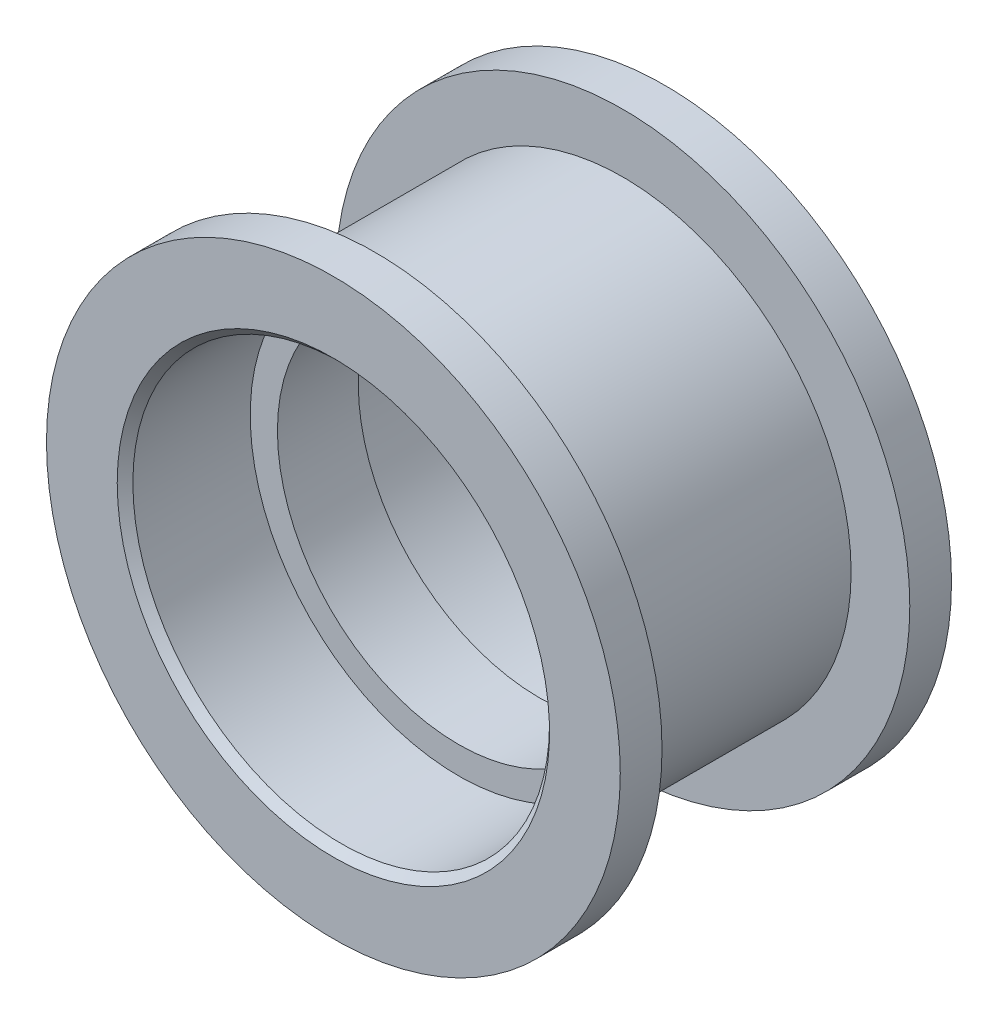
ISO-10303-21;
HEADER;
FILE_DESCRIPTION(('STEP AP214'),'2;1');
FILE_NAME('part.step','',(''),(''),'','','');
FILE_SCHEMA(('AUTOMOTIVE_DESIGN { 1 0 10303 214 1 1 1 1 }'));
ENDSEC;
DATA;
#1=APPLICATION_CONTEXT('core data for automotive mechanical design processes');
#2=APPLICATION_PROTOCOL_DEFINITION('international standard','automotive_design',2000,#1);
#3=PRODUCT_CONTEXT('',#1,'mechanical');
#4=PRODUCT('Part','Part','',(#3));
#5=PRODUCT_RELATED_PRODUCT_CATEGORY('part','',(#4));
#6=PRODUCT_DEFINITION_FORMATION('','',#4);
#7=PRODUCT_DEFINITION_CONTEXT('part definition',#1,'design');
#8=PRODUCT_DEFINITION('design','',#6,#7);
#9=PRODUCT_DEFINITION_SHAPE('','',#8);
#10=(LENGTH_UNIT() NAMED_UNIT(*) SI_UNIT(.MILLI.,.METRE.));
#11=(NAMED_UNIT(*) PLANE_ANGLE_UNIT() SI_UNIT($,.RADIAN.));
#12=(NAMED_UNIT(*) SI_UNIT($,.STERADIAN.) SOLID_ANGLE_UNIT());
#13=UNCERTAINTY_MEASURE_WITH_UNIT(LENGTH_MEASURE(1.E-05),#10,'distance_accuracy_value','');
#14=(GEOMETRIC_REPRESENTATION_CONTEXT(3) GLOBAL_UNCERTAINTY_ASSIGNED_CONTEXT((#13)) GLOBAL_UNIT_ASSIGNED_CONTEXT((#10,
#11,#12)) REPRESENTATION_CONTEXT('',''));
#15=CARTESIAN_POINT('',(0.,0.,0.));
#16=DIRECTION('',(0.,0.,1.));
#17=DIRECTION('',(1.,0.,0.));
#18=AXIS2_PLACEMENT_3D('',#15,#16,#17);
#19=CARTESIAN_POINT('',(0.,0.,0.));
#20=DIRECTION('',(0.,0.,1.));
#21=DIRECTION('',(1.,0.,0.));
#22=AXIS2_PLACEMENT_3D('',#19,#20,#21);
#23=CYLINDRICAL_SURFACE('',#22,6.945);
#24=CARTESIAN_POINT('',(0.,0.,-1.55));
#25=DIRECTION('',(0.,0.,1.));
#26=DIRECTION('',(1.,0.,0.));
#27=AXIS2_PLACEMENT_3D('',#24,#25,#26);
#28=CIRCLE('',#27,6.945);
#29=CARTESIAN_POINT('',(6.945,0.,-1.55));
#30=VERTEX_POINT('',#29);
#31=EDGE_CURVE('E77',#30,#30,#28,.T.);
#32=ORIENTED_EDGE('',*,*,#31,.F.);
#33=EDGE_LOOP('',(#32));
#34=FACE_BOUND('',#33,.T.);
#35=CARTESIAN_POINT('',(0.,0.,1.55));
#36=DIRECTION('',(0.,0.,1.));
#37=DIRECTION('',(1.,0.,0.));
#38=AXIS2_PLACEMENT_3D('',#35,#36,#37);
#39=CIRCLE('',#38,6.945);
#40=CARTESIAN_POINT('',(6.945,0.,1.55));
#41=VERTEX_POINT('',#40);
#42=EDGE_CURVE('E50',#41,#41,#39,.T.);
#43=ORIENTED_EDGE('',*,*,#42,.T.);
#44=EDGE_LOOP('',(#43));
#45=FACE_BOUND('',#44,.T.);
#46=ADVANCED_FACE('F30',(#34,#45),#23,.F.);
#47=CARTESIAN_POINT('',(0.,7.9875,1.55));
#48=DIRECTION('',(0.,0.,-1.));
#49=DIRECTION('',(-1.,0.,0.));
#50=AXIS2_PLACEMENT_3D('',#47,#48,#49);
#51=PLANE('',#50);
#52=ORIENTED_EDGE('',*,*,#42,.F.);
#53=EDGE_LOOP('',(#52));
#54=FACE_BOUND('',#53,.T.);
#55=CARTESIAN_POINT('',(0.,0.,1.55));
#56=DIRECTION('',(0.,0.,1.));
#57=DIRECTION('',(1.,0.,0.));
#58=AXIS2_PLACEMENT_3D('',#55,#56,#57);
#59=CIRCLE('',#58,7.9875);
#60=CARTESIAN_POINT('',(7.9875,0.,1.55));
#61=VERTEX_POINT('',#60);
#62=EDGE_CURVE('E53',#61,#61,#59,.T.);
#63=ORIENTED_EDGE('',*,*,#62,.T.);
#64=EDGE_LOOP('',(#63));
#65=FACE_BOUND('',#64,.T.);
#66=ADVANCED_FACE('F85',(#54,#65),#51,.F.);
#67=CARTESIAN_POINT('',(0.,0.,0.));
#68=DIRECTION('',(0.,0.,1.));
#69=DIRECTION('',(1.,0.,0.));
#70=AXIS2_PLACEMENT_3D('',#67,#68,#69);
#71=CYLINDRICAL_SURFACE('',#70,7.9875);
#72=CARTESIAN_POINT('',(0.,0.,6.05000000000001));
#73=DIRECTION('',(0.,0.,-1.));
#74=DIRECTION('',(-1.,0.,0.));
#75=AXIS2_PLACEMENT_3D('',#72,#73,#74);
#76=CIRCLE('',#75,7.9875);
#77=CARTESIAN_POINT('',(-7.9875,0.,6.05000000000001));
#78=VERTEX_POINT('',#77);
#79=EDGE_CURVE('E37',#78,#78,#76,.F.);
#80=ORIENTED_EDGE('',*,*,#79,.T.);
#81=EDGE_LOOP('',(#80));
#82=FACE_BOUND('',#81,.T.);
#83=ORIENTED_EDGE('',*,*,#62,.F.);
#84=EDGE_LOOP('',(#83));
#85=FACE_BOUND('',#84,.T.);
#86=ADVANCED_FACE('F91',(#82,#85),#71,.F.);
#87=CARTESIAN_POINT('',(0.,11.,6.35));
#88=DIRECTION('',(0.,0.,-1.));
#89=DIRECTION('',(-1.,0.,0.));
#90=AXIS2_PLACEMENT_3D('',#87,#88,#89);
#91=PLANE('',#90);
#92=CARTESIAN_POINT('',(0.,0.,6.35));
#93=DIRECTION('',(0.,0.,-1.));
#94=DIRECTION('',(-1.,0.,0.));
#95=AXIS2_PLACEMENT_3D('',#92,#93,#94);
#96=CIRCLE('',#95,8.28749999999999);
#97=CARTESIAN_POINT('',(-8.28749999999999,0.,6.35));
#98=VERTEX_POINT('',#97);
#99=EDGE_CURVE('E10',#98,#98,#96,.T.);
#100=ORIENTED_EDGE('',*,*,#99,.T.);
#101=EDGE_LOOP('',(#100));
#102=FACE_BOUND('',#101,.T.);
#103=CARTESIAN_POINT('',(0.,0.,6.35));
#104=DIRECTION('',(0.,0.,1.));
#105=DIRECTION('',(1.,0.,0.));
#106=AXIS2_PLACEMENT_3D('',#103,#104,#105);
#107=CIRCLE('',#106,11.);
#108=CARTESIAN_POINT('',(11.,0.,6.35));
#109=VERTEX_POINT('',#108);
#110=EDGE_CURVE('E56',#109,#109,#107,.T.);
#111=ORIENTED_EDGE('',*,*,#110,.T.);
#112=EDGE_LOOP('',(#111));
#113=FACE_BOUND('',#112,.T.);
#114=ADVANCED_FACE('F96',(#102,#113),#91,.F.);
#115=CARTESIAN_POINT('',(0.,0.,0.));
#116=DIRECTION('',(0.,0.,1.));
#117=DIRECTION('',(1.,0.,0.));
#118=AXIS2_PLACEMENT_3D('',#115,#116,#117);
#119=CYLINDRICAL_SURFACE('',#118,11.);
#120=ORIENTED_EDGE('',*,*,#110,.F.);
#121=EDGE_LOOP('',(#120));
#122=FACE_BOUND('',#121,.T.);
#123=CARTESIAN_POINT('',(0.,0.,4.75));
#124=DIRECTION('',(0.,0.,1.));
#125=DIRECTION('',(1.,0.,0.));
#126=AXIS2_PLACEMENT_3D('',#123,#124,#125);
#127=CIRCLE('',#126,11.);
#128=CARTESIAN_POINT('',(11.,0.,4.75));
#129=VERTEX_POINT('',#128);
#130=EDGE_CURVE('E59',#129,#129,#127,.T.);
#131=ORIENTED_EDGE('',*,*,#130,.T.);
#132=EDGE_LOOP('',(#131));
#133=FACE_BOUND('',#132,.T.);
#134=ADVANCED_FACE('F101',(#122,#133),#119,.T.);
#135=CARTESIAN_POINT('',(0.,8.75,4.75));
#136=DIRECTION('',(0.,0.,1.));
#137=DIRECTION('',(1.,0.,0.));
#138=AXIS2_PLACEMENT_3D('',#135,#136,#137);
#139=PLANE('',#138);
#140=ORIENTED_EDGE('',*,*,#130,.F.);
#141=EDGE_LOOP('',(#140));
#142=FACE_BOUND('',#141,.T.);
#143=CARTESIAN_POINT('',(0.,0.,4.75));
#144=DIRECTION('',(0.,0.,1.));
#145=DIRECTION('',(1.,0.,0.));
#146=AXIS2_PLACEMENT_3D('',#143,#144,#145);
#147=CIRCLE('',#146,8.75);
#148=CARTESIAN_POINT('',(8.75,0.,4.75));
#149=VERTEX_POINT('',#148);
#150=EDGE_CURVE('E62',#149,#149,#147,.T.);
#151=ORIENTED_EDGE('',*,*,#150,.T.);
#152=EDGE_LOOP('',(#151));
#153=FACE_BOUND('',#152,.T.);
#154=ADVANCED_FACE('F141',(#142,#153),#139,.F.);
#155=CARTESIAN_POINT('',(0.,0.,0.));
#156=DIRECTION('',(0.,0.,1.));
#157=DIRECTION('',(1.,0.,0.));
#158=AXIS2_PLACEMENT_3D('',#155,#156,#157);
#159=CYLINDRICAL_SURFACE('',#158,8.75);
#160=ORIENTED_EDGE('',*,*,#150,.F.);
#161=EDGE_LOOP('',(#160));
#162=FACE_BOUND('',#161,.T.);
#163=CARTESIAN_POINT('',(0.,0.,-4.75));
#164=DIRECTION('',(0.,0.,1.));
#165=DIRECTION('',(1.,0.,0.));
#166=AXIS2_PLACEMENT_3D('',#163,#164,#165);
#167=CIRCLE('',#166,8.75);
#168=CARTESIAN_POINT('',(8.75,0.,-4.75));
#169=VERTEX_POINT('',#168);
#170=EDGE_CURVE('E65',#169,#169,#167,.T.);
#171=ORIENTED_EDGE('',*,*,#170,.T.);
#172=EDGE_LOOP('',(#171));
#173=FACE_BOUND('',#172,.T.);
#174=ADVANCED_FACE('F133',(#162,#173),#159,.T.);
#175=CARTESIAN_POINT('',(0.,8.75,-4.75));
#176=DIRECTION('',(0.,0.,-1.));
#177=DIRECTION('',(-1.,0.,0.));
#178=AXIS2_PLACEMENT_3D('',#175,#176,#177);
#179=PLANE('',#178);
#180=ORIENTED_EDGE('',*,*,#170,.F.);
#181=EDGE_LOOP('',(#180));
#182=FACE_BOUND('',#181,.T.);
#183=CARTESIAN_POINT('',(0.,0.,-4.75));
#184=DIRECTION('',(0.,0.,1.));
#185=DIRECTION('',(1.,0.,0.));
#186=AXIS2_PLACEMENT_3D('',#183,#184,#185);
#187=CIRCLE('',#186,11.);
#188=CARTESIAN_POINT('',(11.,0.,-4.75));
#189=VERTEX_POINT('',#188);
#190=EDGE_CURVE('E68',#189,#189,#187,.T.);
#191=ORIENTED_EDGE('',*,*,#190,.T.);
#192=EDGE_LOOP('',(#191));
#193=FACE_BOUND('',#192,.T.);
#194=ADVANCED_FACE('F127',(#182,#193),#179,.F.);
#195=CARTESIAN_POINT('',(0.,0.,0.));
#196=DIRECTION('',(0.,0.,1.));
#197=DIRECTION('',(1.,0.,0.));
#198=AXIS2_PLACEMENT_3D('',#195,#196,#197);
#199=CYLINDRICAL_SURFACE('',#198,11.);
#200=ORIENTED_EDGE('',*,*,#190,.F.);
#201=EDGE_LOOP('',(#200));
#202=FACE_BOUND('',#201,.T.);
#203=CARTESIAN_POINT('',(0.,0.,-6.35));
#204=DIRECTION('',(0.,0.,1.));
#205=DIRECTION('',(1.,0.,0.));
#206=AXIS2_PLACEMENT_3D('',#203,#204,#205);
#207=CIRCLE('',#206,11.);
#208=CARTESIAN_POINT('',(11.,0.,-6.35));
#209=VERTEX_POINT('',#208);
#210=EDGE_CURVE('E71',#209,#209,#207,.T.);
#211=ORIENTED_EDGE('',*,*,#210,.T.);
#212=EDGE_LOOP('',(#211));
#213=FACE_BOUND('',#212,.T.);
#214=ADVANCED_FACE('F122',(#202,#213),#199,.T.);
#215=CARTESIAN_POINT('',(0.,11.,-6.35));
#216=DIRECTION('',(0.,0.,1.));
#217=DIRECTION('',(1.,0.,0.));
#218=AXIS2_PLACEMENT_3D('',#215,#216,#217);
#219=PLANE('',#218);
#220=CARTESIAN_POINT('',(0.,0.,-6.35));
#221=DIRECTION('',(0.,0.,1.));
#222=DIRECTION('',(1.,0.,0.));
#223=AXIS2_PLACEMENT_3D('',#220,#221,#222);
#224=CIRCLE('',#223,8.28750000000001);
#225=CARTESIAN_POINT('',(8.28750000000001,0.,-6.35));
#226=VERTEX_POINT('',#225);
#227=EDGE_CURVE('E45',#226,#226,#224,.T.);
#228=ORIENTED_EDGE('',*,*,#227,.T.);
#229=EDGE_LOOP('',(#228));
#230=FACE_BOUND('',#229,.T.);
#231=ORIENTED_EDGE('',*,*,#210,.F.);
#232=EDGE_LOOP('',(#231));
#233=FACE_BOUND('',#232,.T.);
#234=ADVANCED_FACE('F119',(#230,#233),#219,.F.);
#235=CARTESIAN_POINT('',(0.,0.,0.));
#236=DIRECTION('',(0.,0.,1.));
#237=DIRECTION('',(1.,0.,0.));
#238=AXIS2_PLACEMENT_3D('',#235,#236,#237);
#239=CYLINDRICAL_SURFACE('',#238,7.9875);
#240=CARTESIAN_POINT('',(0.,0.,-6.04999999999999));
#241=DIRECTION('',(0.,0.,1.));
#242=DIRECTION('',(1.,0.,0.));
#243=AXIS2_PLACEMENT_3D('',#240,#241,#242);
#244=CIRCLE('',#243,7.9875);
#245=CARTESIAN_POINT('',(7.9875,0.,-6.04999999999999));
#246=VERTEX_POINT('',#245);
#247=EDGE_CURVE('E41',#246,#246,#244,.F.);
#248=ORIENTED_EDGE('',*,*,#247,.T.);
#249=EDGE_LOOP('',(#248));
#250=FACE_BOUND('',#249,.T.);
#251=CARTESIAN_POINT('',(0.,0.,-1.55));
#252=DIRECTION('',(0.,0.,1.));
#253=DIRECTION('',(1.,0.,0.));
#254=AXIS2_PLACEMENT_3D('',#251,#252,#253);
#255=CIRCLE('',#254,7.9875);
#256=CARTESIAN_POINT('',(7.9875,0.,-1.55));
#257=VERTEX_POINT('',#256);
#258=EDGE_CURVE('E74',#257,#257,#255,.T.);
#259=ORIENTED_EDGE('',*,*,#258,.T.);
#260=EDGE_LOOP('',(#259));
#261=FACE_BOUND('',#260,.T.);
#262=ADVANCED_FACE('F112',(#250,#261),#239,.F.);
#263=CARTESIAN_POINT('',(0.,7.9875,-1.55));
#264=DIRECTION('',(0.,0.,1.));
#265=DIRECTION('',(1.,0.,0.));
#266=AXIS2_PLACEMENT_3D('',#263,#264,#265);
#267=PLANE('',#266);
#268=ORIENTED_EDGE('',*,*,#258,.F.);
#269=EDGE_LOOP('',(#268));
#270=FACE_BOUND('',#269,.T.);
#271=ORIENTED_EDGE('',*,*,#31,.T.);
#272=EDGE_LOOP('',(#271));
#273=FACE_BOUND('',#272,.T.);
#274=ADVANCED_FACE('F81',(#270,#273),#267,.F.);
#275=CARTESIAN_POINT('',(0.,0.,-6.35));
#276=DIRECTION('',(0.,0.,-1.));
#277=DIRECTION('',(-1.,0.,0.));
#278=AXIS2_PLACEMENT_3D('',#275,#276,#277);
#279=CONICAL_SURFACE('',#278,8.28750000000001,0.785398163397448);
#280=ORIENTED_EDGE('',*,*,#247,.F.);
#281=EDGE_LOOP('',(#280));
#282=FACE_BOUND('',#281,.T.);
#283=ORIENTED_EDGE('',*,*,#227,.F.);
#284=EDGE_LOOP('',(#283));
#285=FACE_BOUND('',#284,.T.);
#286=ADVANCED_FACE('F104',(#282,#285),#279,.F.);
#287=CARTESIAN_POINT('',(0.,0.,6.05000000000001));
#288=DIRECTION('',(0.,0.,1.));
#289=DIRECTION('',(1.,0.,0.));
#290=AXIS2_PLACEMENT_3D('',#287,#288,#289);
#291=CONICAL_SURFACE('',#290,7.9875,0.785398163397448);
#292=ORIENTED_EDGE('',*,*,#99,.F.);
#293=EDGE_LOOP('',(#292));
#294=FACE_BOUND('',#293,.T.);
#295=ORIENTED_EDGE('',*,*,#79,.F.);
#296=EDGE_LOOP('',(#295));
#297=FACE_BOUND('',#296,.T.);
#298=ADVANCED_FACE('F32',(#294,#297),#291,.F.);
#299=CLOSED_SHELL('',(#46,#66,#86,#114,#134,#154,#174,#194,#214,#234,#262,#274,#286,#298));
#300=MANIFOLD_SOLID_BREP('B2',#299);
#301=ADVANCED_BREP_SHAPE_REPRESENTATION('',(#18,#300),#14);
#302=SHAPE_DEFINITION_REPRESENTATION(#9,#301);
ENDSEC;
END-ISO-10303-21;
